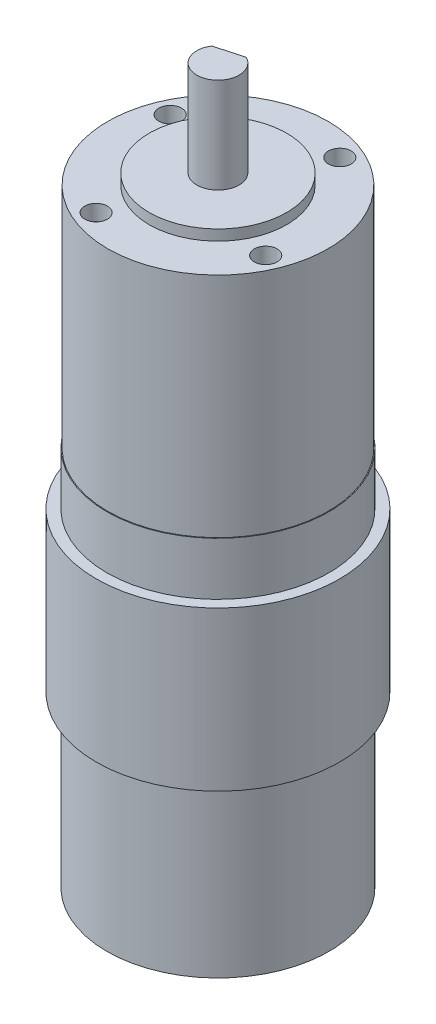
ISO-10303-21;
HEADER;
FILE_DESCRIPTION(('STEP AP214'),'2;1');
FILE_NAME('part.step','',(''),(''),'','','');
FILE_SCHEMA(('AUTOMOTIVE_DESIGN { 1 0 10303 214 1 1 1 1 }'));
ENDSEC;
DATA;
#1=APPLICATION_CONTEXT('core data for automotive mechanical design processes');
#2=APPLICATION_PROTOCOL_DEFINITION('international standard','automotive_design',2000,#1);
#3=PRODUCT_CONTEXT('',#1,'mechanical');
#4=PRODUCT('Part','Part','',(#3));
#5=PRODUCT_RELATED_PRODUCT_CATEGORY('part','',(#4));
#6=PRODUCT_DEFINITION_FORMATION('','',#4);
#7=PRODUCT_DEFINITION_CONTEXT('part definition',#1,'design');
#8=PRODUCT_DEFINITION('design','',#6,#7);
#9=PRODUCT_DEFINITION_SHAPE('','',#8);
#10=(LENGTH_UNIT() NAMED_UNIT(*) SI_UNIT(.MILLI.,.METRE.));
#11=(NAMED_UNIT(*) PLANE_ANGLE_UNIT() SI_UNIT($,.RADIAN.));
#12=(NAMED_UNIT(*) SI_UNIT($,.STERADIAN.) SOLID_ANGLE_UNIT());
#13=UNCERTAINTY_MEASURE_WITH_UNIT(LENGTH_MEASURE(1.E-05),#10,'distance_accuracy_value','');
#14=(GEOMETRIC_REPRESENTATION_CONTEXT(3) GLOBAL_UNCERTAINTY_ASSIGNED_CONTEXT((#13)) GLOBAL_UNIT_ASSIGNED_CONTEXT((#10,
#11,#12)) REPRESENTATION_CONTEXT('',''));
#15=CARTESIAN_POINT('',(0.,0.,0.));
#16=DIRECTION('',(0.,0.,1.));
#17=DIRECTION('',(1.,0.,0.));
#18=AXIS2_PLACEMENT_3D('',#15,#16,#17);
#19=CARTESIAN_POINT('',(0.,0.,0.));
#20=DIRECTION('',(0.,1.,0.));
#21=DIRECTION('',(0.,0.,1.));
#22=AXIS2_PLACEMENT_3D('',#19,#20,#21);
#23=PLANE('',#22);
#24=CARTESIAN_POINT('',(0.,0.,0.));
#25=DIRECTION('',(0.,1.,0.));
#26=DIRECTION('',(0.,0.,1.));
#27=AXIS2_PLACEMENT_3D('',#24,#25,#26);
#28=CIRCLE('',#27,21.);
#29=CARTESIAN_POINT('',(0.,0.,21.));
#30=VERTEX_POINT('',#29);
#31=EDGE_CURVE('E135',#30,#30,#28,.T.);
#32=ORIENTED_EDGE('',*,*,#31,.F.);
#33=EDGE_LOOP('',(#32));
#34=FACE_BOUND('',#33,.T.);
#35=CARTESIAN_POINT('',(0.,0.,0.));
#36=DIRECTION('',(0.,1.,0.));
#37=DIRECTION('',(0.,0.,1.));
#38=AXIS2_PLACEMENT_3D('',#35,#36,#37);
#39=CIRCLE('',#38,7.5);
#40=CARTESIAN_POINT('',(0.,0.,7.5));
#41=VERTEX_POINT('',#40);
#42=EDGE_CURVE('E11',#41,#41,#39,.F.);
#43=ORIENTED_EDGE('',*,*,#42,.F.);
#44=EDGE_LOOP('',(#43));
#45=FACE_BOUND('',#44,.T.);
#46=ADVANCED_FACE('F34',(#34,#45),#23,.F.);
#47=CARTESIAN_POINT('',(0.,117.,0.));
#48=DIRECTION('',(0.,1.,0.));
#49=DIRECTION('',(0.,0.,1.));
#50=AXIS2_PLACEMENT_3D('',#47,#48,#49);
#51=PLANE('',#50);
#52=CARTESIAN_POINT('',(0.,117.,0.));
#53=DIRECTION('',(0.,1.,0.));
#54=DIRECTION('',(0.,0.,1.));
#55=AXIS2_PLACEMENT_3D('',#52,#53,#54);
#56=CIRCLE('',#55,13.);
#57=CARTESIAN_POINT('',(0.,117.,13.));
#58=VERTEX_POINT('',#57);
#59=EDGE_CURVE('E117',#58,#58,#56,.T.);
#60=ORIENTED_EDGE('',*,*,#59,.T.);
#61=EDGE_LOOP('',(#60));
#62=FACE_BOUND('',#61,.T.);
#63=CARTESIAN_POINT('',(0.,117.,0.));
#64=DIRECTION('',(0.,1.,0.));
#65=DIRECTION('',(0.,0.,1.));
#66=AXIS2_PLACEMENT_3D('',#63,#64,#65);
#67=CIRCLE('',#66,4.);
#68=CARTESIAN_POINT('',(0.,117.,4.));
#69=VERTEX_POINT('',#68);
#70=EDGE_CURVE('E112',#69,#69,#67,.T.);
#71=ORIENTED_EDGE('',*,*,#70,.F.);
#72=EDGE_LOOP('',(#71));
#73=FACE_BOUND('',#72,.T.);
#74=ADVANCED_FACE('F158',(#62,#73),#51,.T.);
#75=CARTESIAN_POINT('',(0.,115.,0.));
#76=DIRECTION('',(0.,1.,0.));
#77=DIRECTION('',(0.,0.,1.));
#78=AXIS2_PLACEMENT_3D('',#75,#76,#77);
#79=PLANE('',#78);
#80=CARTESIAN_POINT('',(-7.00624082973821,115.,16.0362897652702));
#81=DIRECTION('',(0.,1.,0.));
#82=DIRECTION('',(0.,0.,1.));
#83=AXIS2_PLACEMENT_3D('',#80,#81,#82);
#84=CIRCLE('',#83,2.15);
#85=CARTESIAN_POINT('',(-7.00624082973821,115.,18.1862897652702));
#86=VERTEX_POINT('',#85);
#87=EDGE_CURVE('E38',#86,#86,#84,.T.);
#88=ORIENTED_EDGE('',*,*,#87,.F.);
#89=EDGE_LOOP('',(#88));
#90=FACE_BOUND('',#89,.T.);
#91=CARTESIAN_POINT('',(16.0362897652703,115.,7.00624082973804));
#92=DIRECTION('',(0.,1.,0.));
#93=DIRECTION('',(0.,0.,1.));
#94=AXIS2_PLACEMENT_3D('',#91,#92,#93);
#95=CIRCLE('',#94,2.15);
#96=CARTESIAN_POINT('',(16.0362897652703,115.,9.15624082973804));
#97=VERTEX_POINT('',#96);
#98=EDGE_CURVE('E100',#97,#97,#95,.T.);
#99=ORIENTED_EDGE('',*,*,#98,.F.);
#100=EDGE_LOOP('',(#99));
#101=FACE_BOUND('',#100,.T.);
#102=CARTESIAN_POINT('',(7.0062408297381,115.,-16.0362897652702));
#103=DIRECTION('',(0.,1.,0.));
#104=DIRECTION('',(0.,0.,1.));
#105=AXIS2_PLACEMENT_3D('',#102,#103,#104);
#106=CIRCLE('',#105,2.15);
#107=CARTESIAN_POINT('',(7.0062408297381,115.,-13.8862897652702));
#108=VERTEX_POINT('',#107);
#109=EDGE_CURVE('E104',#108,#108,#106,.T.);
#110=ORIENTED_EDGE('',*,*,#109,.F.);
#111=EDGE_LOOP('',(#110));
#112=FACE_BOUND('',#111,.T.);
#113=CARTESIAN_POINT('',(-16.0362897652703,115.,-7.00624082973804));
#114=DIRECTION('',(0.,1.,0.));
#115=DIRECTION('',(0.,0.,1.));
#116=AXIS2_PLACEMENT_3D('',#113,#114,#115);
#117=CIRCLE('',#116,2.15);
#118=CARTESIAN_POINT('',(-16.0362897652703,115.,-4.85624082973804));
#119=VERTEX_POINT('',#118);
#120=EDGE_CURVE('E108',#119,#119,#117,.T.);
#121=ORIENTED_EDGE('',*,*,#120,.F.);
#122=EDGE_LOOP('',(#121));
#123=FACE_BOUND('',#122,.T.);
#124=CARTESIAN_POINT('',(0.,115.,0.));
#125=DIRECTION('',(0.,1.,0.));
#126=DIRECTION('',(0.,0.,1.));
#127=AXIS2_PLACEMENT_3D('',#124,#125,#126);
#128=CIRCLE('',#127,20.85);
#129=CARTESIAN_POINT('',(0.,115.,20.85));
#130=VERTEX_POINT('',#129);
#131=EDGE_CURVE('E123',#130,#130,#128,.T.);
#132=ORIENTED_EDGE('',*,*,#131,.T.);
#133=EDGE_LOOP('',(#132));
#134=FACE_BOUND('',#133,.T.);
#135=CARTESIAN_POINT('',(0.,115.,0.));
#136=DIRECTION('',(0.,1.,0.));
#137=DIRECTION('',(0.,0.,1.));
#138=AXIS2_PLACEMENT_3D('',#135,#136,#137);
#139=CIRCLE('',#138,13.);
#140=CARTESIAN_POINT('',(0.,115.,13.));
#141=VERTEX_POINT('',#140);
#142=EDGE_CURVE('E114',#141,#141,#139,.T.);
#143=ORIENTED_EDGE('',*,*,#142,.F.);
#144=EDGE_LOOP('',(#143));
#145=FACE_BOUND('',#144,.T.);
#146=ADVANCED_FACE('F154',(#90,#101,#112,#123,#134,#145),#79,.T.);
#147=CARTESIAN_POINT('',(0.,72.,0.));
#148=DIRECTION('',(0.,1.,0.));
#149=DIRECTION('',(0.,0.,1.));
#150=AXIS2_PLACEMENT_3D('',#147,#148,#149);
#151=PLANE('',#150);
#152=CARTESIAN_POINT('',(0.,72.,0.));
#153=DIRECTION('',(0.,1.,0.));
#154=DIRECTION('',(0.,0.,1.));
#155=AXIS2_PLACEMENT_3D('',#152,#153,#154);
#156=CIRCLE('',#155,21.);
#157=CARTESIAN_POINT('',(0.,72.,21.));
#158=VERTEX_POINT('',#157);
#159=EDGE_CURVE('E138',#158,#158,#156,.T.);
#160=ORIENTED_EDGE('',*,*,#159,.T.);
#161=EDGE_LOOP('',(#160));
#162=FACE_BOUND('',#161,.T.);
#163=CARTESIAN_POINT('',(0.,72.,0.));
#164=DIRECTION('',(0.,1.,0.));
#165=DIRECTION('',(0.,0.,1.));
#166=AXIS2_PLACEMENT_3D('',#163,#164,#165);
#167=CIRCLE('',#166,20.85);
#168=CARTESIAN_POINT('',(0.,72.,20.85));
#169=VERTEX_POINT('',#168);
#170=EDGE_CURVE('E120',#169,#169,#167,.T.);
#171=ORIENTED_EDGE('',*,*,#170,.F.);
#172=EDGE_LOOP('',(#171));
#173=FACE_BOUND('',#172,.T.);
#174=ADVANCED_FACE('F157',(#162,#173),#151,.T.);
#175=CARTESIAN_POINT('',(0.,72.,0.));
#176=DIRECTION('',(0.,-1.,0.));
#177=DIRECTION('',(0.,0.,-1.));
#178=AXIS2_PLACEMENT_3D('',#175,#176,#177);
#179=CYLINDRICAL_SURFACE('',#178,21.);
#180=ORIENTED_EDGE('',*,*,#31,.T.);
#181=EDGE_LOOP('',(#180));
#182=FACE_BOUND('',#181,.T.);
#183=CARTESIAN_POINT('',(0.,32.,0.));
#184=DIRECTION('',(0.,1.,0.));
#185=DIRECTION('',(0.,0.,1.));
#186=AXIS2_PLACEMENT_3D('',#183,#184,#185);
#187=CIRCLE('',#186,21.);
#188=CARTESIAN_POINT('',(0.,32.,21.));
#189=VERTEX_POINT('',#188);
#190=EDGE_CURVE('E43',#189,#189,#187,.T.);
#191=ORIENTED_EDGE('',*,*,#190,.F.);
#192=EDGE_LOOP('',(#191));
#193=FACE_BOUND('',#192,.T.);
#194=ADVANCED_FACE('F195',(#182,#193),#179,.T.);
#195=CARTESIAN_POINT('',(0.,32.,0.));
#196=DIRECTION('',(0.,1.,0.));
#197=DIRECTION('',(0.,0.,1.));
#198=AXIS2_PLACEMENT_3D('',#195,#196,#197);
#199=CYLINDRICAL_SURFACE('',#198,23.);
#200=CARTESIAN_POINT('',(0.,32.,0.));
#201=DIRECTION('',(0.,1.,0.));
#202=DIRECTION('',(0.,0.,1.));
#203=AXIS2_PLACEMENT_3D('',#200,#201,#202);
#204=CIRCLE('',#203,23.);
#205=CARTESIAN_POINT('',(0.,32.,23.));
#206=VERTEX_POINT('',#205);
#207=EDGE_CURVE('E132',#206,#206,#204,.T.);
#208=ORIENTED_EDGE('',*,*,#207,.T.);
#209=EDGE_LOOP('',(#208));
#210=FACE_BOUND('',#209,.T.);
#211=CARTESIAN_POINT('',(0.,62.,0.));
#212=DIRECTION('',(0.,1.,0.));
#213=DIRECTION('',(0.,0.,1.));
#214=AXIS2_PLACEMENT_3D('',#211,#212,#213);
#215=CIRCLE('',#214,23.);
#216=CARTESIAN_POINT('',(0.,62.,23.));
#217=VERTEX_POINT('',#216);
#218=EDGE_CURVE('E131',#217,#217,#215,.T.);
#219=ORIENTED_EDGE('',*,*,#218,.F.);
#220=EDGE_LOOP('',(#219));
#221=FACE_BOUND('',#220,.T.);
#222=ADVANCED_FACE('F197',(#210,#221),#199,.T.);
#223=CARTESIAN_POINT('',(0.,32.,0.));
#224=DIRECTION('',(0.,1.,0.));
#225=DIRECTION('',(0.,0.,1.));
#226=AXIS2_PLACEMENT_3D('',#223,#224,#225);
#227=PLANE('',#226);
#228=ORIENTED_EDGE('',*,*,#190,.T.);
#229=EDGE_LOOP('',(#228));
#230=FACE_BOUND('',#229,.T.);
#231=ORIENTED_EDGE('',*,*,#207,.F.);
#232=EDGE_LOOP('',(#231));
#233=FACE_BOUND('',#232,.T.);
#234=ADVANCED_FACE('F200',(#230,#233),#227,.F.);
#235=CARTESIAN_POINT('',(0.,62.,0.));
#236=DIRECTION('',(0.,1.,0.));
#237=DIRECTION('',(0.,0.,1.));
#238=AXIS2_PLACEMENT_3D('',#235,#236,#237);
#239=PLANE('',#238);
#240=CARTESIAN_POINT('',(0.,62.,0.));
#241=DIRECTION('',(0.,1.,0.));
#242=DIRECTION('',(0.,0.,1.));
#243=AXIS2_PLACEMENT_3D('',#240,#241,#242);
#244=CIRCLE('',#243,21.);
#245=CARTESIAN_POINT('',(0.,62.,21.));
#246=VERTEX_POINT('',#245);
#247=EDGE_CURVE('E126',#246,#246,#244,.T.);
#248=ORIENTED_EDGE('',*,*,#247,.F.);
#249=EDGE_LOOP('',(#248));
#250=FACE_BOUND('',#249,.T.);
#251=ORIENTED_EDGE('',*,*,#218,.T.);
#252=EDGE_LOOP('',(#251));
#253=FACE_BOUND('',#252,.T.);
#254=ADVANCED_FACE('F202',(#250,#253),#239,.T.);
#255=ORIENTED_EDGE('',*,*,#247,.T.);
#256=EDGE_LOOP('',(#255));
#257=FACE_BOUND('',#256,.T.);
#258=ORIENTED_EDGE('',*,*,#159,.F.);
#259=EDGE_LOOP('',(#258));
#260=FACE_BOUND('',#259,.T.);
#261=ADVANCED_FACE('F36',(#257,#260),#179,.T.);
#262=CARTESIAN_POINT('',(0.,115.,0.));
#263=DIRECTION('',(0.,-1.,0.));
#264=DIRECTION('',(0.,0.,-1.));
#265=AXIS2_PLACEMENT_3D('',#262,#263,#264);
#266=CYLINDRICAL_SURFACE('',#265,20.85);
#267=ORIENTED_EDGE('',*,*,#131,.F.);
#268=EDGE_LOOP('',(#267));
#269=FACE_BOUND('',#268,.T.);
#270=ORIENTED_EDGE('',*,*,#170,.T.);
#271=EDGE_LOOP('',(#270));
#272=FACE_BOUND('',#271,.T.);
#273=ADVANCED_FACE('F171',(#269,#272),#266,.T.);
#274=CARTESIAN_POINT('',(0.,117.,0.));
#275=DIRECTION('',(0.,-1.,0.));
#276=DIRECTION('',(0.,0.,-1.));
#277=AXIS2_PLACEMENT_3D('',#274,#275,#276);
#278=CYLINDRICAL_SURFACE('',#277,13.);
#279=ORIENTED_EDGE('',*,*,#59,.F.);
#280=EDGE_LOOP('',(#279));
#281=FACE_BOUND('',#280,.T.);
#282=ORIENTED_EDGE('',*,*,#142,.T.);
#283=EDGE_LOOP('',(#282));
#284=FACE_BOUND('',#283,.T.);
#285=ADVANCED_FACE('F169',(#281,#284),#278,.T.);
#286=CARTESIAN_POINT('',(0.,135.,0.));
#287=DIRECTION('',(0.,-1.,0.));
#288=DIRECTION('',(0.,0.,-1.));
#289=AXIS2_PLACEMENT_3D('',#286,#287,#288);
#290=CYLINDRICAL_SURFACE('',#289,4.);
#291=CARTESIAN_POINT('',(0.,135.,0.));
#292=DIRECTION('',(0.,1.,0.));
#293=DIRECTION('',(0.,0.,1.));
#294=AXIS2_PLACEMENT_3D('',#291,#292,#293);
#295=CIRCLE('',#294,4.);
#296=CARTESIAN_POINT('',(-3.34564225454129,135.,-2.19241371657539));
#297=VERTEX_POINT('',#296);
#298=CARTESIAN_POINT('',(1.75701276756684,135.,-3.59345323256156));
#299=VERTEX_POINT('',#298);
#300=EDGE_CURVE('E89',#297,#299,#295,.T.);
#301=ORIENTED_EDGE('',*,*,#300,.F.);
#302=DIRECTION('',(0.,1.,0.));
#303=VECTOR('',#302,1.);
#304=CARTESIAN_POINT('',(-3.34564225454129,125.,-2.19241371657539));
#305=LINE('',#304,#303);
#306=CARTESIAN_POINT('',(-3.34564225454129,125.,-2.19241371657539));
#307=VERTEX_POINT('',#306);
#308=EDGE_CURVE('E51',#307,#297,#305,.T.);
#309=ORIENTED_EDGE('',*,*,#308,.F.);
#310=CARTESIAN_POINT('',(0.,125.,0.));
#311=DIRECTION('',(0.,1.,0.));
#312=DIRECTION('',(0.,0.,1.));
#313=AXIS2_PLACEMENT_3D('',#310,#311,#312);
#314=CIRCLE('',#313,4.);
#315=CARTESIAN_POINT('',(1.75701276756684,125.,-3.59345323256156));
#316=VERTEX_POINT('',#315);
#317=EDGE_CURVE('E75',#316,#307,#314,.T.);
#318=ORIENTED_EDGE('',*,*,#317,.F.);
#319=DIRECTION('',(0.,1.,0.));
#320=VECTOR('',#319,1.);
#321=CARTESIAN_POINT('',(1.75701276756684,125.,-3.59345323256156));
#322=LINE('',#321,#320);
#323=EDGE_CURVE('E83',#316,#299,#322,.T.);
#324=ORIENTED_EDGE('',*,*,#323,.T.);
#325=EDGE_LOOP('',(#301,#309,#318,#324));
#326=FACE_BOUND('',#325,.T.);
#327=ORIENTED_EDGE('',*,*,#70,.T.);
#328=EDGE_LOOP('',(#327));
#329=FACE_BOUND('',#328,.T.);
#330=ADVANCED_FACE('F86',(#326,#329),#290,.T.);
#331=CARTESIAN_POINT('',(0.,135.,0.));
#332=DIRECTION('',(0.,1.,0.));
#333=DIRECTION('',(0.,0.,1.));
#334=AXIS2_PLACEMENT_3D('',#331,#332,#333);
#335=PLANE('',#334);
#336=DIRECTION('',(0.964311158189492,0.,-0.264771581162408));
#337=VECTOR('',#336,1.);
#338=CARTESIAN_POINT('',(-3.34564225454129,135.,-2.19241371657539));
#339=LINE('',#338,#337);
#340=EDGE_CURVE('E80',#297,#299,#339,.T.);
#341=ORIENTED_EDGE('',*,*,#340,.F.);
#342=ORIENTED_EDGE('',*,*,#300,.T.);
#343=EDGE_LOOP('',(#341,#342));
#344=FACE_BOUND('',#343,.T.);
#345=ADVANCED_FACE('F178',(#344),#335,.T.);
#346=CARTESIAN_POINT('',(0.,-5.,0.));
#347=DIRECTION('',(0.,1.,0.));
#348=DIRECTION('',(0.,0.,1.));
#349=AXIS2_PLACEMENT_3D('',#346,#347,#348);
#350=CYLINDRICAL_SURFACE('',#349,7.5);
#351=CARTESIAN_POINT('',(0.,-5.,0.));
#352=DIRECTION('',(0.,-1.,0.));
#353=DIRECTION('',(0.,0.,-1.));
#354=AXIS2_PLACEMENT_3D('',#351,#352,#353);
#355=CIRCLE('',#354,7.5);
#356=CARTESIAN_POINT('',(0.,-5.,-7.5));
#357=VERTEX_POINT('',#356);
#358=EDGE_CURVE('E109',#357,#357,#355,.T.);
#359=ORIENTED_EDGE('',*,*,#358,.F.);
#360=EDGE_LOOP('',(#359));
#361=FACE_BOUND('',#360,.T.);
#362=ORIENTED_EDGE('',*,*,#42,.T.);
#363=EDGE_LOOP('',(#362));
#364=FACE_BOUND('',#363,.T.);
#365=ADVANCED_FACE('F260',(#361,#364),#350,.T.);
#366=CARTESIAN_POINT('',(0.,-5.,0.));
#367=DIRECTION('',(0.,-1.,0.));
#368=DIRECTION('',(0.,0.,-1.));
#369=AXIS2_PLACEMENT_3D('',#366,#367,#368);
#370=PLANE('',#369);
#371=ORIENTED_EDGE('',*,*,#358,.T.);
#372=EDGE_LOOP('',(#371));
#373=FACE_BOUND('',#372,.T.);
#374=ADVANCED_FACE('F254',(#373),#370,.T.);
#375=CARTESIAN_POINT('',(-16.0362897652703,112.,-7.00624082973804));
#376=DIRECTION('',(0.,1.,0.));
#377=DIRECTION('',(0.,0.,1.));
#378=AXIS2_PLACEMENT_3D('',#375,#376,#377);
#379=CONICAL_SURFACE('',#378,2.15,1.02974425867665);
#380=CARTESIAN_POINT('',(-16.0362897652703,110.708149669091,-7.00624082973804));
#381=VERTEX_POINT('',#380);
#382=VERTEX_LOOP('',#381);
#383=FACE_BOUND('',#382,.T.);
#384=CARTESIAN_POINT('',(-16.0362897652703,112.,-7.00624082973804));
#385=DIRECTION('',(0.,1.,0.));
#386=DIRECTION('',(0.,0.,1.));
#387=AXIS2_PLACEMENT_3D('',#384,#385,#386);
#388=CIRCLE('',#387,2.15);
#389=CARTESIAN_POINT('',(-16.0362897652703,112.,-4.85624082973804));
#390=VERTEX_POINT('',#389);
#391=EDGE_CURVE('E105',#390,#390,#388,.T.);
#392=ORIENTED_EDGE('',*,*,#391,.T.);
#393=EDGE_LOOP('',(#392));
#394=FACE_BOUND('',#393,.T.);
#395=ADVANCED_FACE('F259',(#383,#394),#379,.F.);
#396=CARTESIAN_POINT('',(-16.0362897652703,117.,-7.00624082973804));
#397=DIRECTION('',(0.,1.,0.));
#398=DIRECTION('',(0.,0.,1.));
#399=AXIS2_PLACEMENT_3D('',#396,#397,#398);
#400=CYLINDRICAL_SURFACE('',#399,2.15);
#401=ORIENTED_EDGE('',*,*,#120,.T.);
#402=EDGE_LOOP('',(#401));
#403=FACE_BOUND('',#402,.T.);
#404=ORIENTED_EDGE('',*,*,#391,.F.);
#405=EDGE_LOOP('',(#404));
#406=FACE_BOUND('',#405,.T.);
#407=ADVANCED_FACE('F359',(#403,#406),#400,.F.);
#408=CARTESIAN_POINT('',(7.0062408297381,112.,-16.0362897652702));
#409=DIRECTION('',(0.,1.,0.));
#410=DIRECTION('',(0.,0.,1.));
#411=AXIS2_PLACEMENT_3D('',#408,#409,#410);
#412=CONICAL_SURFACE('',#411,2.15,1.02974425867665);
#413=CARTESIAN_POINT('',(7.0062408297381,110.708149669091,-16.0362897652702));
#414=VERTEX_POINT('',#413);
#415=VERTEX_LOOP('',#414);
#416=FACE_BOUND('',#415,.T.);
#417=CARTESIAN_POINT('',(7.0062408297381,112.,-16.0362897652702));
#418=DIRECTION('',(0.,1.,0.));
#419=DIRECTION('',(0.,0.,1.));
#420=AXIS2_PLACEMENT_3D('',#417,#418,#419);
#421=CIRCLE('',#420,2.15);
#422=CARTESIAN_POINT('',(7.0062408297381,112.,-13.8862897652702));
#423=VERTEX_POINT('',#422);
#424=EDGE_CURVE('E101',#423,#423,#421,.T.);
#425=ORIENTED_EDGE('',*,*,#424,.T.);
#426=EDGE_LOOP('',(#425));
#427=FACE_BOUND('',#426,.T.);
#428=ADVANCED_FACE('F350',(#416,#427),#412,.F.);
#429=CARTESIAN_POINT('',(7.0062408297381,117.,-16.0362897652702));
#430=DIRECTION('',(0.,1.,0.));
#431=DIRECTION('',(0.,0.,1.));
#432=AXIS2_PLACEMENT_3D('',#429,#430,#431);
#433=CYLINDRICAL_SURFACE('',#432,2.15);
#434=ORIENTED_EDGE('',*,*,#109,.T.);
#435=EDGE_LOOP('',(#434));
#436=FACE_BOUND('',#435,.T.);
#437=ORIENTED_EDGE('',*,*,#424,.F.);
#438=EDGE_LOOP('',(#437));
#439=FACE_BOUND('',#438,.T.);
#440=ADVANCED_FACE('F341',(#436,#439),#433,.F.);
#441=CARTESIAN_POINT('',(16.0362897652703,112.,7.00624082973804));
#442=DIRECTION('',(0.,1.,0.));
#443=DIRECTION('',(0.,0.,1.));
#444=AXIS2_PLACEMENT_3D('',#441,#442,#443);
#445=CONICAL_SURFACE('',#444,2.15,1.02974425867665);
#446=CARTESIAN_POINT('',(16.0362897652703,110.708149669091,7.00624082973804));
#447=VERTEX_POINT('',#446);
#448=VERTEX_LOOP('',#447);
#449=FACE_BOUND('',#448,.T.);
#450=CARTESIAN_POINT('',(16.0362897652703,112.,7.00624082973804));
#451=DIRECTION('',(0.,1.,0.));
#452=DIRECTION('',(0.,0.,1.));
#453=AXIS2_PLACEMENT_3D('',#450,#451,#452);
#454=CIRCLE('',#453,2.15);
#455=CARTESIAN_POINT('',(16.0362897652703,112.,9.15624082973804));
#456=VERTEX_POINT('',#455);
#457=EDGE_CURVE('E97',#456,#456,#454,.T.);
#458=ORIENTED_EDGE('',*,*,#457,.T.);
#459=EDGE_LOOP('',(#458));
#460=FACE_BOUND('',#459,.T.);
#461=ADVANCED_FACE('F332',(#449,#460),#445,.F.);
#462=CARTESIAN_POINT('',(16.0362897652703,117.,7.00624082973804));
#463=DIRECTION('',(0.,1.,0.));
#464=DIRECTION('',(0.,0.,1.));
#465=AXIS2_PLACEMENT_3D('',#462,#463,#464);
#466=CYLINDRICAL_SURFACE('',#465,2.15);
#467=ORIENTED_EDGE('',*,*,#98,.T.);
#468=EDGE_LOOP('',(#467));
#469=FACE_BOUND('',#468,.T.);
#470=ORIENTED_EDGE('',*,*,#457,.F.);
#471=EDGE_LOOP('',(#470));
#472=FACE_BOUND('',#471,.T.);
#473=ADVANCED_FACE('F151',(#469,#472),#466,.F.);
#474=CARTESIAN_POINT('',(-7.00624082973821,112.,16.0362897652702));
#475=DIRECTION('',(0.,1.,0.));
#476=DIRECTION('',(0.,0.,1.));
#477=AXIS2_PLACEMENT_3D('',#474,#475,#476);
#478=CONICAL_SURFACE('',#477,2.15,1.02974425867665);
#479=CARTESIAN_POINT('',(-7.00624082973821,110.708149669091,16.0362897652702));
#480=VERTEX_POINT('',#479);
#481=VERTEX_LOOP('',#480);
#482=FACE_BOUND('',#481,.T.);
#483=CARTESIAN_POINT('',(-7.00624082973821,112.,16.0362897652702));
#484=DIRECTION('',(0.,1.,0.));
#485=DIRECTION('',(0.,0.,1.));
#486=AXIS2_PLACEMENT_3D('',#483,#484,#485);
#487=CIRCLE('',#486,2.15);
#488=CARTESIAN_POINT('',(-7.00624082973821,112.,18.1862897652702));
#489=VERTEX_POINT('',#488);
#490=EDGE_CURVE('E91',#489,#489,#487,.T.);
#491=ORIENTED_EDGE('',*,*,#490,.T.);
#492=EDGE_LOOP('',(#491));
#493=FACE_BOUND('',#492,.T.);
#494=ADVANCED_FACE('F311',(#482,#493),#478,.F.);
#495=CARTESIAN_POINT('',(-7.00624082973821,117.,16.0362897652702));
#496=DIRECTION('',(0.,1.,0.));
#497=DIRECTION('',(0.,0.,1.));
#498=AXIS2_PLACEMENT_3D('',#495,#496,#497);
#499=CYLINDRICAL_SURFACE('',#498,2.15);
#500=ORIENTED_EDGE('',*,*,#87,.T.);
#501=EDGE_LOOP('',(#500));
#502=FACE_BOUND('',#501,.T.);
#503=ORIENTED_EDGE('',*,*,#490,.F.);
#504=EDGE_LOOP('',(#503));
#505=FACE_BOUND('',#504,.T.);
#506=ADVANCED_FACE('F306',(#502,#505),#499,.F.);
#507=CARTESIAN_POINT('',(-3.34564225454129,125.,-2.19241371657539));
#508=DIRECTION('',(0.264771581162408,0.,0.964311158189492));
#509=DIRECTION('',(0.964311158189492,0.,-0.264771581162408));
#510=AXIS2_PLACEMENT_3D('',#507,#508,#509);
#511=PLANE('',#510);
#512=ORIENTED_EDGE('',*,*,#340,.T.);
#513=ORIENTED_EDGE('',*,*,#323,.F.);
#514=DIRECTION('',(0.964311158189492,0.,-0.264771581162408));
#515=VECTOR('',#514,1.);
#516=CARTESIAN_POINT('',(-3.34564225454129,125.,-2.19241371657539));
#517=LINE('',#516,#515);
#518=EDGE_CURVE('E77',#307,#316,#517,.T.);
#519=ORIENTED_EDGE('',*,*,#518,.F.);
#520=ORIENTED_EDGE('',*,*,#308,.T.);
#521=EDGE_LOOP('',(#512,#513,#519,#520));
#522=FACE_BOUND('',#521,.T.);
#523=ADVANCED_FACE('F82',(#522),#511,.F.);
#524=CARTESIAN_POINT('',(0.,125.,0.));
#525=DIRECTION('',(0.,1.,0.));
#526=DIRECTION('',(0.,0.,1.));
#527=AXIS2_PLACEMENT_3D('',#524,#525,#526);
#528=PLANE('',#527);
#529=ORIENTED_EDGE('',*,*,#317,.T.);
#530=ORIENTED_EDGE('',*,*,#518,.T.);
#531=EDGE_LOOP('',(#529,#530));
#532=FACE_BOUND('',#531,.T.);
#533=ADVANCED_FACE('F76',(#532),#528,.T.);
#534=CLOSED_SHELL('',(#46,#74,#146,#174,#194,#222,#234,#254,#261,#273,#285,#330,#345,#365,#374,
#395,#407,#428,#440,#461,#473,#494,#506,#523,#533));
#535=MANIFOLD_SOLID_BREP('B2',#534);
#536=ADVANCED_BREP_SHAPE_REPRESENTATION('',(#18,#535),#14);
#537=SHAPE_DEFINITION_REPRESENTATION(#9,#536);
ENDSEC;
END-ISO-10303-21;
